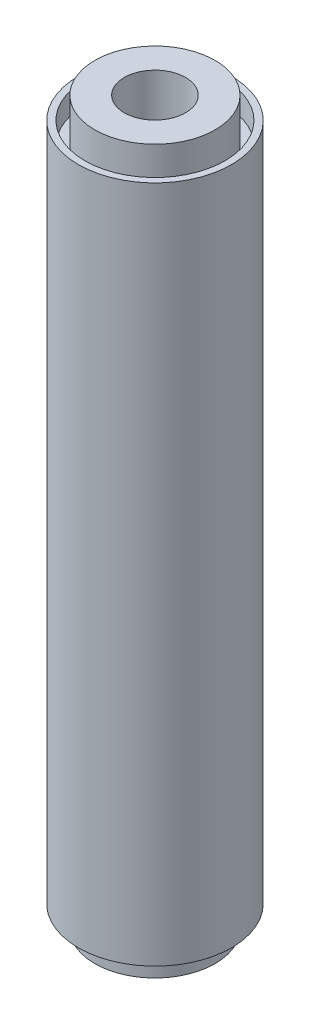
ISO-10303-21;
HEADER;
FILE_DESCRIPTION(('STEP AP214'),'2;1');
FILE_NAME('part.step','',(''),(''),'','','');
FILE_SCHEMA(('AUTOMOTIVE_DESIGN { 1 0 10303 214 1 1 1 1 }'));
ENDSEC;
DATA;
#1=APPLICATION_CONTEXT('core data for automotive mechanical design processes');
#2=APPLICATION_PROTOCOL_DEFINITION('international standard','automotive_design',2000,#1);
#3=PRODUCT_CONTEXT('',#1,'mechanical');
#4=PRODUCT('Part','Part','',(#3));
#5=PRODUCT_RELATED_PRODUCT_CATEGORY('part','',(#4));
#6=PRODUCT_DEFINITION_FORMATION('','',#4);
#7=PRODUCT_DEFINITION_CONTEXT('part definition',#1,'design');
#8=PRODUCT_DEFINITION('design','',#6,#7);
#9=PRODUCT_DEFINITION_SHAPE('','',#8);
#10=(LENGTH_UNIT() NAMED_UNIT(*) SI_UNIT(.MILLI.,.METRE.));
#11=(NAMED_UNIT(*) PLANE_ANGLE_UNIT() SI_UNIT($,.RADIAN.));
#12=(NAMED_UNIT(*) SI_UNIT($,.STERADIAN.) SOLID_ANGLE_UNIT());
#13=UNCERTAINTY_MEASURE_WITH_UNIT(LENGTH_MEASURE(1.E-05),#10,'distance_accuracy_value','');
#14=(GEOMETRIC_REPRESENTATION_CONTEXT(3) GLOBAL_UNCERTAINTY_ASSIGNED_CONTEXT((#13)) GLOBAL_UNIT_ASSIGNED_CONTEXT((#10,
#11,#12)) REPRESENTATION_CONTEXT('',''));
#15=CARTESIAN_POINT('',(0.,0.,0.));
#16=DIRECTION('',(0.,0.,1.));
#17=DIRECTION('',(1.,0.,0.));
#18=AXIS2_PLACEMENT_3D('',#15,#16,#17);
#19=CARTESIAN_POINT('',(0.,355.6,0.));
#20=DIRECTION('',(0.,1.,0.));
#21=DIRECTION('',(0.,0.,1.));
#22=AXIS2_PLACEMENT_3D('',#19,#20,#21);
#23=PLANE('',#22);
#24=CARTESIAN_POINT('',(0.,355.6,0.));
#25=DIRECTION('',(0.,1.,0.));
#26=DIRECTION('',(0.,0.,1.));
#27=AXIS2_PLACEMENT_3D('',#24,#25,#26);
#28=CIRCLE('',#27,17.78);
#29=CARTESIAN_POINT('',(0.,355.6,17.78));
#30=VERTEX_POINT('',#29);
#31=EDGE_CURVE('E43',#30,#30,#28,.T.);
#32=ORIENTED_EDGE('',*,*,#31,.T.);
#33=EDGE_LOOP('',(#32));
#34=FACE_BOUND('',#33,.T.);
#35=CARTESIAN_POINT('',(0.,355.6,0.));
#36=DIRECTION('',(0.,1.,0.));
#37=DIRECTION('',(0.,0.,1.));
#38=AXIS2_PLACEMENT_3D('',#35,#36,#37);
#39=CIRCLE('',#38,40.64);
#40=CARTESIAN_POINT('',(0.,355.6,40.64));
#41=VERTEX_POINT('',#40);
#42=EDGE_CURVE('E63',#41,#41,#39,.T.);
#43=ORIENTED_EDGE('',*,*,#42,.F.);
#44=EDGE_LOOP('',(#43));
#45=FACE_BOUND('',#44,.T.);
#46=ADVANCED_FACE('F39',(#34,#45),#23,.F.);
#47=CARTESIAN_POINT('',(0.,393.7,0.));
#48=DIRECTION('',(0.,-1.,0.));
#49=DIRECTION('',(0.,0.,-1.));
#50=AXIS2_PLACEMENT_3D('',#47,#48,#49);
#51=CYLINDRICAL_SURFACE('',#50,40.64);
#52=ORIENTED_EDGE('',*,*,#42,.T.);
#53=EDGE_LOOP('',(#52));
#54=FACE_BOUND('',#53,.T.);
#55=CARTESIAN_POINT('',(2.66050878019847E-13,38.1,0.));
#56=DIRECTION('',(0.,-1.,0.));
#57=DIRECTION('',(1.,0.,0.));
#58=AXIS2_PLACEMENT_3D('',#55,#56,#57);
#59=CIRCLE('',#58,40.64);
#60=CARTESIAN_POINT('',(40.6400000000003,38.0999999999997,0.));
#61=VERTEX_POINT('',#60);
#62=EDGE_CURVE('E72',#61,#61,#59,.T.);
#63=ORIENTED_EDGE('',*,*,#62,.T.);
#64=EDGE_LOOP('',(#63));
#65=FACE_BOUND('',#64,.T.);
#66=ADVANCED_FACE('F105',(#54,#65),#51,.F.);
#67=CARTESIAN_POINT('',(2.66050878019847E-13,38.1,0.));
#68=DIRECTION('',(0.,-1.,0.));
#69=DIRECTION('',(1.,0.,0.));
#70=AXIS2_PLACEMENT_3D('',#67,#68,#69);
#71=PLANE('',#70);
#72=ORIENTED_EDGE('',*,*,#62,.F.);
#73=EDGE_LOOP('',(#72));
#74=FACE_BOUND('',#73,.T.);
#75=ADVANCED_FACE('F95',(#74),#71,.F.);
#76=CARTESIAN_POINT('',(0.,254.,0.));
#77=DIRECTION('',(0.,1.,0.));
#78=DIRECTION('',(0.,0.,1.));
#79=AXIS2_PLACEMENT_3D('',#76,#77,#78);
#80=CYLINDRICAL_SURFACE('',#79,17.78);
#81=CARTESIAN_POINT('',(0.,406.4,0.));
#82=DIRECTION('',(0.,1.,0.));
#83=DIRECTION('',(0.,0.,1.));
#84=AXIS2_PLACEMENT_3D('',#81,#82,#83);
#85=CIRCLE('',#84,17.78);
#86=CARTESIAN_POINT('',(0.,406.4,17.78));
#87=VERTEX_POINT('',#86);
#88=EDGE_CURVE('E83',#87,#87,#85,.T.);
#89=ORIENTED_EDGE('',*,*,#88,.T.);
#90=EDGE_LOOP('',(#89));
#91=FACE_BOUND('',#90,.T.);
#92=ORIENTED_EDGE('',*,*,#31,.F.);
#93=EDGE_LOOP('',(#92));
#94=FACE_BOUND('',#93,.T.);
#95=ADVANCED_FACE('F92',(#91,#94),#80,.F.);
#96=CARTESIAN_POINT('',(0.,12.7,0.));
#97=DIRECTION('',(0.,-1.,0.));
#98=DIRECTION('',(1.,0.,0.));
#99=AXIS2_PLACEMENT_3D('',#96,#97,#98);
#100=CIRCLE('',#99,40.64);
#101=CARTESIAN_POINT('',(40.64,12.6999999999997,0.));
#102=VERTEX_POINT('',#101);
#103=EDGE_CURVE('E10',#102,#102,#100,.T.);
#104=ORIENTED_EDGE('',*,*,#103,.F.);
#105=EDGE_LOOP('',(#104));
#106=FACE_BOUND('',#105,.T.);
#107=CARTESIAN_POINT('',(0.,0.,0.));
#108=DIRECTION('',(0.,1.,0.));
#109=DIRECTION('',(0.,0.,1.));
#110=AXIS2_PLACEMENT_3D('',#107,#108,#109);
#111=CIRCLE('',#110,40.64);
#112=CARTESIAN_POINT('',(0.,0.,40.64));
#113=VERTEX_POINT('',#112);
#114=EDGE_CURVE('E60',#113,#113,#111,.T.);
#115=ORIENTED_EDGE('',*,*,#114,.F.);
#116=EDGE_LOOP('',(#115));
#117=FACE_BOUND('',#116,.T.);
#118=ADVANCED_FACE('F94',(#106,#117),#51,.F.);
#119=CARTESIAN_POINT('',(0.,393.7,0.));
#120=DIRECTION('',(0.,1.,0.));
#121=DIRECTION('',(0.,0.,1.));
#122=AXIS2_PLACEMENT_3D('',#119,#120,#121);
#123=PLANE('',#122);
#124=CARTESIAN_POINT('',(0.,393.7,0.));
#125=DIRECTION('',(0.,1.,0.));
#126=DIRECTION('',(0.,0.,1.));
#127=AXIS2_PLACEMENT_3D('',#124,#125,#126);
#128=CIRCLE('',#127,44.45);
#129=CARTESIAN_POINT('',(0.,393.7,44.45));
#130=VERTEX_POINT('',#129);
#131=EDGE_CURVE('E51',#130,#130,#128,.T.);
#132=ORIENTED_EDGE('',*,*,#131,.T.);
#133=EDGE_LOOP('',(#132));
#134=FACE_BOUND('',#133,.T.);
#135=CARTESIAN_POINT('',(0.,393.7,0.));
#136=DIRECTION('',(0.,1.,0.));
#137=DIRECTION('',(0.,0.,1.));
#138=AXIS2_PLACEMENT_3D('',#135,#136,#137);
#139=CIRCLE('',#138,40.64);
#140=CARTESIAN_POINT('',(0.,393.7,40.64));
#141=VERTEX_POINT('',#140);
#142=EDGE_CURVE('E57',#141,#141,#139,.T.);
#143=ORIENTED_EDGE('',*,*,#142,.F.);
#144=EDGE_LOOP('',(#143));
#145=FACE_BOUND('',#144,.T.);
#146=ADVANCED_FACE('F101',(#134,#145),#123,.T.);
#147=CARTESIAN_POINT('',(0.,0.,0.));
#148=DIRECTION('',(0.,1.,0.));
#149=DIRECTION('',(0.,0.,1.));
#150=AXIS2_PLACEMENT_3D('',#147,#148,#149);
#151=PLANE('',#150);
#152=CARTESIAN_POINT('',(0.,0.,0.));
#153=DIRECTION('',(0.,1.,0.));
#154=DIRECTION('',(0.,0.,1.));
#155=AXIS2_PLACEMENT_3D('',#152,#153,#154);
#156=CIRCLE('',#155,44.45);
#157=CARTESIAN_POINT('',(0.,0.,44.45));
#158=VERTEX_POINT('',#157);
#159=EDGE_CURVE('E54',#158,#158,#156,.T.);
#160=ORIENTED_EDGE('',*,*,#159,.F.);
#161=EDGE_LOOP('',(#160));
#162=FACE_BOUND('',#161,.T.);
#163=ORIENTED_EDGE('',*,*,#114,.T.);
#164=EDGE_LOOP('',(#163));
#165=FACE_BOUND('',#164,.T.);
#166=ADVANCED_FACE('F122',(#162,#165),#151,.F.);
#167=CARTESIAN_POINT('',(0.,393.7,0.));
#168=DIRECTION('',(0.,-1.,0.));
#169=DIRECTION('',(0.,0.,-1.));
#170=AXIS2_PLACEMENT_3D('',#167,#168,#169);
#171=CYLINDRICAL_SURFACE('',#170,44.45);
#172=ORIENTED_EDGE('',*,*,#131,.F.);
#173=EDGE_LOOP('',(#172));
#174=FACE_BOUND('',#173,.T.);
#175=ORIENTED_EDGE('',*,*,#159,.T.);
#176=EDGE_LOOP('',(#175));
#177=FACE_BOUND('',#176,.T.);
#178=ADVANCED_FACE('F41',(#174,#177),#171,.T.);
#179=CARTESIAN_POINT('',(0.,381.,0.));
#180=DIRECTION('',(0.,1.,0.));
#181=DIRECTION('',(0.,0.,1.));
#182=AXIS2_PLACEMENT_3D('',#179,#180,#181);
#183=CIRCLE('',#182,40.64);
#184=CARTESIAN_POINT('',(0.,381.,40.64));
#185=VERTEX_POINT('',#184);
#186=EDGE_CURVE('E47',#185,#185,#183,.T.);
#187=ORIENTED_EDGE('',*,*,#186,.F.);
#188=EDGE_LOOP('',(#187));
#189=FACE_BOUND('',#188,.T.);
#190=ORIENTED_EDGE('',*,*,#142,.T.);
#191=EDGE_LOOP('',(#190));
#192=FACE_BOUND('',#191,.T.);
#193=ADVANCED_FACE('F104',(#189,#192),#51,.F.);
#194=CARTESIAN_POINT('',(0.,381.,0.));
#195=DIRECTION('',(0.,1.,0.));
#196=DIRECTION('',(0.,0.,1.));
#197=AXIS2_PLACEMENT_3D('',#194,#195,#196);
#198=PLANE('',#197);
#199=CARTESIAN_POINT('',(0.,381.,0.));
#200=DIRECTION('',(0.,1.,0.));
#201=DIRECTION('',(0.,0.,1.));
#202=AXIS2_PLACEMENT_3D('',#199,#200,#201);
#203=CIRCLE('',#202,34.925);
#204=CARTESIAN_POINT('',(0.,381.,34.925));
#205=VERTEX_POINT('',#204);
#206=EDGE_CURVE('E69',#205,#205,#203,.T.);
#207=ORIENTED_EDGE('',*,*,#206,.F.);
#208=EDGE_LOOP('',(#207));
#209=FACE_BOUND('',#208,.T.);
#210=ORIENTED_EDGE('',*,*,#186,.T.);
#211=EDGE_LOOP('',(#210));
#212=FACE_BOUND('',#211,.T.);
#213=ADVANCED_FACE('F116',(#209,#212),#198,.T.);
#214=CARTESIAN_POINT('',(0.,406.4,0.));
#215=DIRECTION('',(0.,-1.,0.));
#216=DIRECTION('',(0.,0.,-1.));
#217=AXIS2_PLACEMENT_3D('',#214,#215,#216);
#218=CYLINDRICAL_SURFACE('',#217,34.925);
#219=CARTESIAN_POINT('',(0.,406.4,0.));
#220=DIRECTION('',(0.,1.,0.));
#221=DIRECTION('',(0.,0.,1.));
#222=AXIS2_PLACEMENT_3D('',#219,#220,#221);
#223=CIRCLE('',#222,34.925);
#224=CARTESIAN_POINT('',(0.,406.4,34.925));
#225=VERTEX_POINT('',#224);
#226=EDGE_CURVE('E68',#225,#225,#223,.T.);
#227=ORIENTED_EDGE('',*,*,#226,.F.);
#228=EDGE_LOOP('',(#227));
#229=FACE_BOUND('',#228,.T.);
#230=ORIENTED_EDGE('',*,*,#206,.T.);
#231=EDGE_LOOP('',(#230));
#232=FACE_BOUND('',#231,.T.);
#233=ADVANCED_FACE('F151',(#229,#232),#218,.T.);
#234=CARTESIAN_POINT('',(0.,406.4,0.));
#235=DIRECTION('',(0.,1.,0.));
#236=DIRECTION('',(0.,0.,1.));
#237=AXIS2_PLACEMENT_3D('',#234,#235,#236);
#238=PLANE('',#237);
#239=ORIENTED_EDGE('',*,*,#88,.F.);
#240=EDGE_LOOP('',(#239));
#241=FACE_BOUND('',#240,.T.);
#242=ORIENTED_EDGE('',*,*,#226,.T.);
#243=EDGE_LOOP('',(#242));
#244=FACE_BOUND('',#243,.T.);
#245=ADVANCED_FACE('F158',(#241,#244),#238,.T.);
#246=CARTESIAN_POINT('',(0.,12.7,0.));
#247=DIRECTION('',(0.,-1.,0.));
#248=DIRECTION('',(1.,0.,0.));
#249=AXIS2_PLACEMENT_3D('',#246,#247,#248);
#250=PLANE('',#249);
#251=CARTESIAN_POINT('',(0.,12.7,0.));
#252=DIRECTION('',(0.,-1.,0.));
#253=DIRECTION('',(1.,0.,0.));
#254=AXIS2_PLACEMENT_3D('',#251,#252,#253);
#255=CIRCLE('',#254,34.925);
#256=CARTESIAN_POINT('',(34.9250000000001,12.6999999999998,0.));
#257=VERTEX_POINT('',#256);
#258=EDGE_CURVE('E78',#257,#257,#255,.T.);
#259=ORIENTED_EDGE('',*,*,#258,.F.);
#260=EDGE_LOOP('',(#259));
#261=FACE_BOUND('',#260,.T.);
#262=ORIENTED_EDGE('',*,*,#103,.T.);
#263=EDGE_LOOP('',(#262));
#264=FACE_BOUND('',#263,.T.);
#265=ADVANCED_FACE('F166',(#261,#264),#250,.T.);
#266=CARTESIAN_POINT('',(0.,-12.7,0.));
#267=DIRECTION('',(0.,1.,0.));
#268=DIRECTION('',(-1.,0.,0.));
#269=AXIS2_PLACEMENT_3D('',#266,#267,#268);
#270=CYLINDRICAL_SURFACE('',#269,34.925);
#271=CARTESIAN_POINT('',(0.,-12.7,0.));
#272=DIRECTION('',(0.,-1.,0.));
#273=DIRECTION('',(1.,0.,0.));
#274=AXIS2_PLACEMENT_3D('',#271,#272,#273);
#275=CIRCLE('',#274,34.925);
#276=CARTESIAN_POINT('',(34.9249999999999,-12.7000000000002,0.));
#277=VERTEX_POINT('',#276);
#278=EDGE_CURVE('E77',#277,#277,#275,.T.);
#279=ORIENTED_EDGE('',*,*,#278,.F.);
#280=EDGE_LOOP('',(#279));
#281=FACE_BOUND('',#280,.T.);
#282=ORIENTED_EDGE('',*,*,#258,.T.);
#283=EDGE_LOOP('',(#282));
#284=FACE_BOUND('',#283,.T.);
#285=ADVANCED_FACE('F174',(#281,#284),#270,.T.);
#286=CARTESIAN_POINT('',(0.,-12.7,0.));
#287=DIRECTION('',(0.,-1.,0.));
#288=DIRECTION('',(1.,0.,0.));
#289=AXIS2_PLACEMENT_3D('',#286,#287,#288);
#290=PLANE('',#289);
#291=ORIENTED_EDGE('',*,*,#278,.T.);
#292=EDGE_LOOP('',(#291));
#293=FACE_BOUND('',#292,.T.);
#294=ADVANCED_FACE('F183',(#293),#290,.T.);
#295=CLOSED_SHELL('',(#46,#66,#75,#95,#118,#146,#166,#178,#193,#213,#233,#245,#265,#285,#294));
#296=MANIFOLD_SOLID_BREP('B2',#295);
#297=ADVANCED_BREP_SHAPE_REPRESENTATION('',(#18,#296),#14);
#298=SHAPE_DEFINITION_REPRESENTATION(#9,#297);
ENDSEC;
END-ISO-10303-21;
